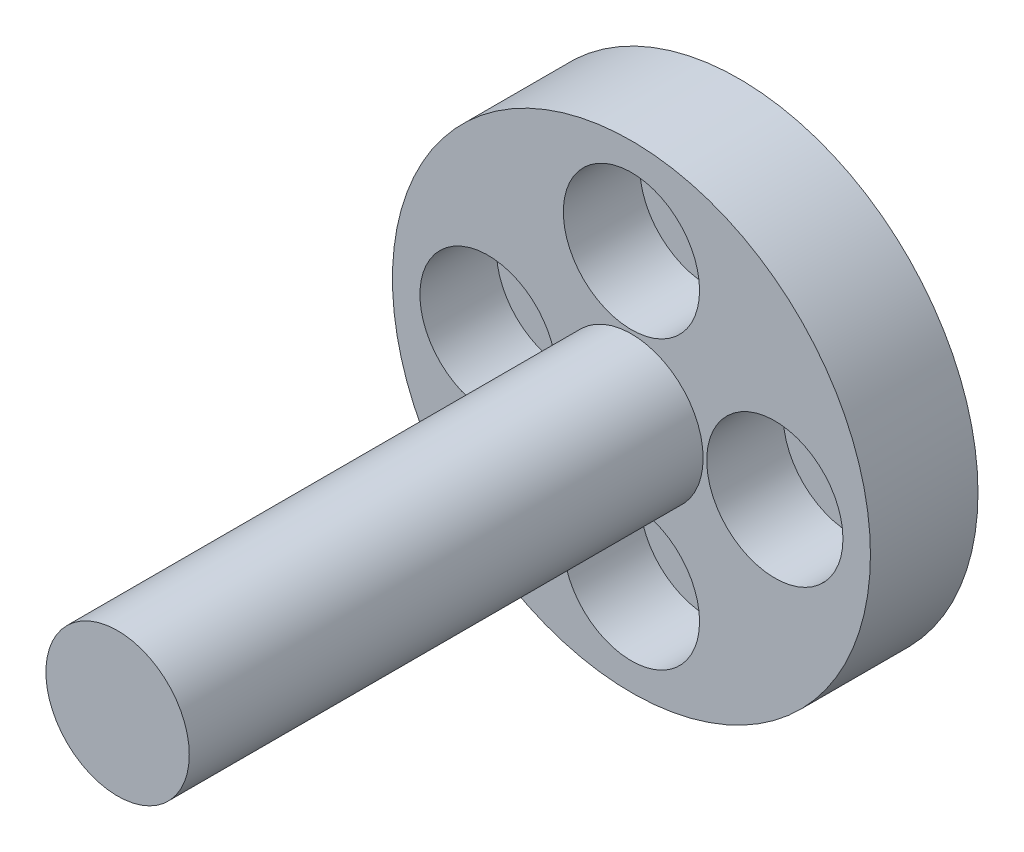
ISO-10303-21;
HEADER;
FILE_DESCRIPTION(('STEP AP214'),'2;1');
FILE_NAME('part.step','',(''),(''),'','','');
FILE_SCHEMA(('AUTOMOTIVE_DESIGN { 1 0 10303 214 1 1 1 1 }'));
ENDSEC;
DATA;
#1=APPLICATION_CONTEXT('core data for automotive mechanical design processes');
#2=APPLICATION_PROTOCOL_DEFINITION('international standard','automotive_design',2000,#1);
#3=PRODUCT_CONTEXT('',#1,'mechanical');
#4=PRODUCT('Part','Part','',(#3));
#5=PRODUCT_RELATED_PRODUCT_CATEGORY('part','',(#4));
#6=PRODUCT_DEFINITION_FORMATION('','',#4);
#7=PRODUCT_DEFINITION_CONTEXT('part definition',#1,'design');
#8=PRODUCT_DEFINITION('design','',#6,#7);
#9=PRODUCT_DEFINITION_SHAPE('','',#8);
#10=(LENGTH_UNIT() NAMED_UNIT(*) SI_UNIT(.MILLI.,.METRE.));
#11=(NAMED_UNIT(*) PLANE_ANGLE_UNIT() SI_UNIT($,.RADIAN.));
#12=(NAMED_UNIT(*) SI_UNIT($,.STERADIAN.) SOLID_ANGLE_UNIT());
#13=UNCERTAINTY_MEASURE_WITH_UNIT(LENGTH_MEASURE(1.E-05),#10,'distance_accuracy_value','');
#14=(GEOMETRIC_REPRESENTATION_CONTEXT(3) GLOBAL_UNCERTAINTY_ASSIGNED_CONTEXT((#13)) GLOBAL_UNIT_ASSIGNED_CONTEXT((#10,
#11,#12)) REPRESENTATION_CONTEXT('',''));
#15=CARTESIAN_POINT('',(0.,0.,0.));
#16=DIRECTION('',(0.,0.,1.));
#17=DIRECTION('',(1.,0.,0.));
#18=AXIS2_PLACEMENT_3D('',#15,#16,#17);
#19=CARTESIAN_POINT('',(6.,0.,26.));
#20=DIRECTION('',(0.,0.,-1.));
#21=DIRECTION('',(-1.,0.,0.));
#22=AXIS2_PLACEMENT_3D('',#19,#20,#21);
#23=CYLINDRICAL_SURFACE('',#22,1.60000000000006);
#24=CARTESIAN_POINT('',(6.,0.,0.));
#25=DIRECTION('',(0.,0.,-1.));
#26=DIRECTION('',(-1.,0.,0.));
#27=AXIS2_PLACEMENT_3D('',#24,#25,#26);
#28=CIRCLE('',#27,1.60000000000006);
#29=CARTESIAN_POINT('',(4.39999999999994,0.,0.));
#30=VERTEX_POINT('',#29);
#31=EDGE_CURVE('E70',#30,#30,#28,.T.);
#32=ORIENTED_EDGE('',*,*,#31,.T.);
#33=EDGE_LOOP('',(#32));
#34=FACE_BOUND('',#33,.T.);
#35=CARTESIAN_POINT('',(6.,0.,1.3));
#36=DIRECTION('',(0.,0.,1.));
#37=DIRECTION('',(1.,0.,0.));
#38=AXIS2_PLACEMENT_3D('',#35,#36,#37);
#39=CIRCLE('',#38,1.60000000000006);
#40=CARTESIAN_POINT('',(7.60000000000006,0.,1.3));
#41=VERTEX_POINT('',#40);
#42=EDGE_CURVE('E42',#41,#41,#39,.F.);
#43=ORIENTED_EDGE('',*,*,#42,.F.);
#44=EDGE_LOOP('',(#43));
#45=FACE_BOUND('',#44,.T.);
#46=ADVANCED_FACE('F38',(#34,#45),#23,.F.);
#47=CARTESIAN_POINT('',(0.,-6.,26.));
#48=DIRECTION('',(0.,0.,-1.));
#49=DIRECTION('',(-1.,0.,0.));
#50=AXIS2_PLACEMENT_3D('',#47,#48,#49);
#51=CYLINDRICAL_SURFACE('',#50,1.60000000000004);
#52=CARTESIAN_POINT('',(0.,-6.,0.));
#53=DIRECTION('',(0.,0.,-1.));
#54=DIRECTION('',(-1.,0.,0.));
#55=AXIS2_PLACEMENT_3D('',#52,#53,#54);
#56=CIRCLE('',#55,1.60000000000004);
#57=CARTESIAN_POINT('',(-1.60000000000004,-6.,0.));
#58=VERTEX_POINT('',#57);
#59=EDGE_CURVE('E74',#58,#58,#56,.T.);
#60=ORIENTED_EDGE('',*,*,#59,.T.);
#61=EDGE_LOOP('',(#60));
#62=FACE_BOUND('',#61,.T.);
#63=CARTESIAN_POINT('',(0.,-6.,1.3));
#64=DIRECTION('',(0.,0.,1.));
#65=DIRECTION('',(1.,0.,0.));
#66=AXIS2_PLACEMENT_3D('',#63,#64,#65);
#67=CIRCLE('',#66,1.60000000000004);
#68=CARTESIAN_POINT('',(1.60000000000004,-6.,1.3));
#69=VERTEX_POINT('',#68);
#70=EDGE_CURVE('E65',#69,#69,#67,.F.);
#71=ORIENTED_EDGE('',*,*,#70,.F.);
#72=EDGE_LOOP('',(#71));
#73=FACE_BOUND('',#72,.T.);
#74=ADVANCED_FACE('F160',(#62,#73),#51,.F.);
#75=CARTESIAN_POINT('',(-6.,0.,26.));
#76=DIRECTION('',(0.,0.,-1.));
#77=DIRECTION('',(-1.,0.,0.));
#78=AXIS2_PLACEMENT_3D('',#75,#76,#77);
#79=CYLINDRICAL_SURFACE('',#78,1.60000000000002);
#80=CARTESIAN_POINT('',(-6.,0.,0.));
#81=DIRECTION('',(0.,0.,-1.));
#82=DIRECTION('',(-1.,0.,0.));
#83=AXIS2_PLACEMENT_3D('',#80,#81,#82);
#84=CIRCLE('',#83,1.60000000000002);
#85=CARTESIAN_POINT('',(-7.60000000000002,0.,0.));
#86=VERTEX_POINT('',#85);
#87=EDGE_CURVE('E79',#86,#86,#84,.T.);
#88=ORIENTED_EDGE('',*,*,#87,.T.);
#89=EDGE_LOOP('',(#88));
#90=FACE_BOUND('',#89,.T.);
#91=CARTESIAN_POINT('',(-6.,0.,1.3));
#92=DIRECTION('',(0.,0.,1.));
#93=DIRECTION('',(1.,0.,0.));
#94=AXIS2_PLACEMENT_3D('',#91,#92,#93);
#95=CIRCLE('',#94,1.60000000000002);
#96=CARTESIAN_POINT('',(-4.39999999999998,0.,1.3));
#97=VERTEX_POINT('',#96);
#98=EDGE_CURVE('E62',#97,#97,#95,.F.);
#99=ORIENTED_EDGE('',*,*,#98,.F.);
#100=EDGE_LOOP('',(#99));
#101=FACE_BOUND('',#100,.T.);
#102=ADVANCED_FACE('F165',(#90,#101),#79,.F.);
#103=CARTESIAN_POINT('',(0.,6.,26.));
#104=DIRECTION('',(0.,0.,-1.));
#105=DIRECTION('',(-1.,0.,0.));
#106=AXIS2_PLACEMENT_3D('',#103,#104,#105);
#107=CYLINDRICAL_SURFACE('',#106,1.6);
#108=CARTESIAN_POINT('',(0.,6.,0.));
#109=DIRECTION('',(0.,0.,-1.));
#110=DIRECTION('',(-1.,0.,0.));
#111=AXIS2_PLACEMENT_3D('',#108,#109,#110);
#112=CIRCLE('',#111,1.6);
#113=CARTESIAN_POINT('',(-1.6,6.,0.));
#114=VERTEX_POINT('',#113);
#115=EDGE_CURVE('E87',#114,#114,#112,.T.);
#116=ORIENTED_EDGE('',*,*,#115,.T.);
#117=EDGE_LOOP('',(#116));
#118=FACE_BOUND('',#117,.T.);
#119=CARTESIAN_POINT('',(0.,6.,1.3));
#120=DIRECTION('',(0.,0.,1.));
#121=DIRECTION('',(1.,0.,0.));
#122=AXIS2_PLACEMENT_3D('',#119,#120,#121);
#123=CIRCLE('',#122,1.6);
#124=CARTESIAN_POINT('',(1.6,6.,1.3));
#125=VERTEX_POINT('',#124);
#126=EDGE_CURVE('E59',#125,#125,#123,.F.);
#127=ORIENTED_EDGE('',*,*,#126,.F.);
#128=EDGE_LOOP('',(#127));
#129=FACE_BOUND('',#128,.T.);
#130=ADVANCED_FACE('F146',(#118,#129),#107,.F.);
#131=CARTESIAN_POINT('',(0.,0.,4.5));
#132=DIRECTION('',(0.,0.,-1.));
#133=DIRECTION('',(-1.,0.,0.));
#134=AXIS2_PLACEMENT_3D('',#131,#132,#133);
#135=CYLINDRICAL_SURFACE('',#134,10.);
#136=CARTESIAN_POINT('',(0.,0.,4.5));
#137=DIRECTION('',(0.,0.,1.));
#138=DIRECTION('',(1.,0.,0.));
#139=AXIS2_PLACEMENT_3D('',#136,#137,#138);
#140=CIRCLE('',#139,10.);
#141=CARTESIAN_POINT('',(10.,0.,4.5));
#142=VERTEX_POINT('',#141);
#143=EDGE_CURVE('E46',#142,#142,#140,.T.);
#144=ORIENTED_EDGE('',*,*,#143,.F.);
#145=EDGE_LOOP('',(#144));
#146=FACE_BOUND('',#145,.T.);
#147=CARTESIAN_POINT('',(0.,0.,0.));
#148=DIRECTION('',(0.,0.,1.));
#149=DIRECTION('',(1.,0.,0.));
#150=AXIS2_PLACEMENT_3D('',#147,#148,#149);
#151=CIRCLE('',#150,10.);
#152=CARTESIAN_POINT('',(10.,0.,0.));
#153=VERTEX_POINT('',#152);
#154=EDGE_CURVE('E51',#153,#153,#151,.T.);
#155=ORIENTED_EDGE('',*,*,#154,.T.);
#156=EDGE_LOOP('',(#155));
#157=FACE_BOUND('',#156,.T.);
#158=ADVANCED_FACE('F40',(#146,#157),#135,.T.);
#159=CARTESIAN_POINT('',(0.,0.,4.5));
#160=DIRECTION('',(0.,0.,1.));
#161=DIRECTION('',(1.,0.,0.));
#162=AXIS2_PLACEMENT_3D('',#159,#160,#161);
#163=PLANE('',#162);
#164=CARTESIAN_POINT('',(0.,6.,4.5));
#165=DIRECTION('',(0.,0.,1.));
#166=DIRECTION('',(1.,0.,0.));
#167=AXIS2_PLACEMENT_3D('',#164,#165,#166);
#168=CIRCLE('',#167,2.85);
#169=CARTESIAN_POINT('',(2.85,6.,4.5));
#170=VERTEX_POINT('',#169);
#171=EDGE_CURVE('E114',#170,#170,#168,.T.);
#172=ORIENTED_EDGE('',*,*,#171,.F.);
#173=EDGE_LOOP('',(#172));
#174=FACE_BOUND('',#173,.T.);
#175=CARTESIAN_POINT('',(6.00000000000017,1.69428074463191E-13,4.5));
#176=DIRECTION('',(0.,0.,1.));
#177=DIRECTION('',(1.,0.,0.));
#178=AXIS2_PLACEMENT_3D('',#175,#176,#177);
#179=CIRCLE('',#178,2.85000000000013);
#180=CARTESIAN_POINT('',(8.8500000000003,1.69428074463191E-13,4.5));
#181=VERTEX_POINT('',#180);
#182=EDGE_CURVE('E108',#181,#181,#179,.T.);
#183=ORIENTED_EDGE('',*,*,#182,.F.);
#184=EDGE_LOOP('',(#183));
#185=FACE_BOUND('',#184,.T.);
#186=CARTESIAN_POINT('',(3.38856148926383E-13,-6.,4.5));
#187=DIRECTION('',(0.,0.,1.));
#188=DIRECTION('',(1.,0.,0.));
#189=AXIS2_PLACEMENT_3D('',#186,#187,#188);
#190=CIRCLE('',#189,2.85000000000036);
#191=CARTESIAN_POINT('',(2.8500000000007,-6.,4.5));
#192=VERTEX_POINT('',#191);
#193=EDGE_CURVE('E102',#192,#192,#190,.T.);
#194=ORIENTED_EDGE('',*,*,#193,.F.);
#195=EDGE_LOOP('',(#194));
#196=FACE_BOUND('',#195,.T.);
#197=CARTESIAN_POINT('',(-5.99999999999983,-1.7016286254268E-13,4.5));
#198=DIRECTION('',(0.,0.,1.));
#199=DIRECTION('',(1.,0.,0.));
#200=AXIS2_PLACEMENT_3D('',#197,#198,#199);
#201=CIRCLE('',#200,2.85000000000027);
#202=CARTESIAN_POINT('',(-3.14999999999956,-1.7016286254268E-13,4.5));
#203=VERTEX_POINT('',#202);
#204=EDGE_CURVE('E96',#203,#203,#201,.T.);
#205=ORIENTED_EDGE('',*,*,#204,.F.);
#206=EDGE_LOOP('',(#205));
#207=FACE_BOUND('',#206,.T.);
#208=CARTESIAN_POINT('',(0.,0.,4.5));
#209=DIRECTION('',(0.,0.,1.));
#210=DIRECTION('',(1.,0.,0.));
#211=AXIS2_PLACEMENT_3D('',#208,#209,#210);
#212=CIRCLE('',#211,3.);
#213=CARTESIAN_POINT('',(3.,0.,4.5));
#214=VERTEX_POINT('',#213);
#215=EDGE_CURVE('E10',#214,#214,#212,.T.);
#216=ORIENTED_EDGE('',*,*,#215,.F.);
#217=EDGE_LOOP('',(#216));
#218=FACE_BOUND('',#217,.T.);
#219=ORIENTED_EDGE('',*,*,#143,.T.);
#220=EDGE_LOOP('',(#219));
#221=FACE_BOUND('',#220,.T.);
#222=ADVANCED_FACE('F130',(#174,#185,#196,#207,#218,#221),#163,.T.);
#223=CARTESIAN_POINT('',(0.,0.,0.));
#224=DIRECTION('',(0.,0.,1.));
#225=DIRECTION('',(1.,0.,0.));
#226=AXIS2_PLACEMENT_3D('',#223,#224,#225);
#227=PLANE('',#226);
#228=ORIENTED_EDGE('',*,*,#115,.F.);
#229=EDGE_LOOP('',(#228));
#230=FACE_BOUND('',#229,.T.);
#231=ORIENTED_EDGE('',*,*,#87,.F.);
#232=EDGE_LOOP('',(#231));
#233=FACE_BOUND('',#232,.T.);
#234=ORIENTED_EDGE('',*,*,#59,.F.);
#235=EDGE_LOOP('',(#234));
#236=FACE_BOUND('',#235,.T.);
#237=ORIENTED_EDGE('',*,*,#31,.F.);
#238=EDGE_LOOP('',(#237));
#239=FACE_BOUND('',#238,.T.);
#240=CARTESIAN_POINT('',(0.,0.,0.));
#241=DIRECTION('',(0.,0.,-1.));
#242=DIRECTION('',(-1.,0.,0.));
#243=AXIS2_PLACEMENT_3D('',#240,#241,#242);
#244=CIRCLE('',#243,2.);
#245=CARTESIAN_POINT('',(-2.,0.,0.));
#246=VERTEX_POINT('',#245);
#247=EDGE_CURVE('E85',#246,#246,#244,.T.);
#248=ORIENTED_EDGE('',*,*,#247,.F.);
#249=EDGE_LOOP('',(#248));
#250=FACE_BOUND('',#249,.T.);
#251=ORIENTED_EDGE('',*,*,#154,.F.);
#252=EDGE_LOOP('',(#251));
#253=FACE_BOUND('',#252,.T.);
#254=ADVANCED_FACE('F133',(#230,#233,#236,#239,#250,#253),#227,.F.);
#255=CARTESIAN_POINT('',(0.,0.,26.));
#256=DIRECTION('',(0.,0.,-1.));
#257=DIRECTION('',(-1.,0.,0.));
#258=AXIS2_PLACEMENT_3D('',#255,#256,#257);
#259=CYLINDRICAL_SURFACE('',#258,3.);
#260=CARTESIAN_POINT('',(0.,0.,26.));
#261=DIRECTION('',(0.,0.,1.));
#262=DIRECTION('',(1.,0.,0.));
#263=AXIS2_PLACEMENT_3D('',#260,#261,#262);
#264=CIRCLE('',#263,3.);
#265=CARTESIAN_POINT('',(3.,0.,26.));
#266=VERTEX_POINT('',#265);
#267=EDGE_CURVE('E54',#266,#266,#264,.T.);
#268=ORIENTED_EDGE('',*,*,#267,.F.);
#269=EDGE_LOOP('',(#268));
#270=FACE_BOUND('',#269,.T.);
#271=ORIENTED_EDGE('',*,*,#215,.T.);
#272=EDGE_LOOP('',(#271));
#273=FACE_BOUND('',#272,.T.);
#274=ADVANCED_FACE('F150',(#270,#273),#259,.T.);
#275=CARTESIAN_POINT('',(0.,0.,26.));
#276=DIRECTION('',(0.,0.,1.));
#277=DIRECTION('',(1.,0.,0.));
#278=AXIS2_PLACEMENT_3D('',#275,#276,#277);
#279=PLANE('',#278);
#280=ORIENTED_EDGE('',*,*,#267,.T.);
#281=EDGE_LOOP('',(#280));
#282=FACE_BOUND('',#281,.T.);
#283=ADVANCED_FACE('F155',(#282),#279,.T.);
#284=CARTESIAN_POINT('',(0.,0.,6.5));
#285=DIRECTION('',(0.,0.,-1.));
#286=DIRECTION('',(-1.,0.,0.));
#287=AXIS2_PLACEMENT_3D('',#284,#285,#286);
#288=CYLINDRICAL_SURFACE('',#287,2.);
#289=CARTESIAN_POINT('',(0.,0.,6.5));
#290=DIRECTION('',(0.,0.,-1.));
#291=DIRECTION('',(-1.,0.,0.));
#292=AXIS2_PLACEMENT_3D('',#289,#290,#291);
#293=CIRCLE('',#292,2.);
#294=CARTESIAN_POINT('',(-2.,0.,6.5));
#295=VERTEX_POINT('',#294);
#296=EDGE_CURVE('E83',#295,#295,#293,.T.);
#297=ORIENTED_EDGE('',*,*,#296,.F.);
#298=EDGE_LOOP('',(#297));
#299=FACE_BOUND('',#298,.T.);
#300=ORIENTED_EDGE('',*,*,#247,.T.);
#301=EDGE_LOOP('',(#300));
#302=FACE_BOUND('',#301,.T.);
#303=ADVANCED_FACE('F174',(#299,#302),#288,.F.);
#304=CARTESIAN_POINT('',(0.,0.,6.5));
#305=DIRECTION('',(0.,0.,-1.));
#306=DIRECTION('',(-1.,0.,0.));
#307=AXIS2_PLACEMENT_3D('',#304,#305,#306);
#308=PLANE('',#307);
#309=ORIENTED_EDGE('',*,*,#296,.T.);
#310=EDGE_LOOP('',(#309));
#311=FACE_BOUND('',#310,.T.);
#312=ADVANCED_FACE('F171',(#311),#308,.T.);
#313=CARTESIAN_POINT('',(0.,6.,1.3));
#314=DIRECTION('',(0.,0.,1.));
#315=DIRECTION('',(1.,0.,0.));
#316=AXIS2_PLACEMENT_3D('',#313,#314,#315);
#317=PLANE('',#316);
#318=CARTESIAN_POINT('',(0.,6.,1.3));
#319=DIRECTION('',(0.,0.,1.));
#320=DIRECTION('',(1.,0.,0.));
#321=AXIS2_PLACEMENT_3D('',#318,#319,#320);
#322=CIRCLE('',#321,2.85);
#323=CARTESIAN_POINT('',(2.85,6.,1.3));
#324=VERTEX_POINT('',#323);
#325=EDGE_CURVE('E63',#324,#324,#322,.T.);
#326=ORIENTED_EDGE('',*,*,#325,.T.);
#327=EDGE_LOOP('',(#326));
#328=FACE_BOUND('',#327,.T.);
#329=ORIENTED_EDGE('',*,*,#126,.T.);
#330=EDGE_LOOP('',(#329));
#331=FACE_BOUND('',#330,.T.);
#332=ADVANCED_FACE('F120',(#328,#331),#317,.T.);
#333=CARTESIAN_POINT('',(0.,6.,1.3));
#334=DIRECTION('',(0.,0.,1.));
#335=DIRECTION('',(1.,0.,0.));
#336=AXIS2_PLACEMENT_3D('',#333,#334,#335);
#337=CYLINDRICAL_SURFACE('',#336,2.85);
#338=ORIENTED_EDGE('',*,*,#325,.F.);
#339=EDGE_LOOP('',(#338));
#340=FACE_BOUND('',#339,.T.);
#341=ORIENTED_EDGE('',*,*,#171,.T.);
#342=EDGE_LOOP('',(#341));
#343=FACE_BOUND('',#342,.T.);
#344=ADVANCED_FACE('F123',(#340,#343),#337,.F.);
#345=CARTESIAN_POINT('',(-5.99999999999983,-1.7016286254268E-13,1.3));
#346=DIRECTION('',(0.,0.,1.));
#347=DIRECTION('',(1.,0.,0.));
#348=AXIS2_PLACEMENT_3D('',#345,#346,#347);
#349=PLANE('',#348);
#350=CARTESIAN_POINT('',(-5.99999999999983,-1.7016286254268E-13,1.3));
#351=DIRECTION('',(0.,0.,1.));
#352=DIRECTION('',(1.,0.,0.));
#353=AXIS2_PLACEMENT_3D('',#350,#351,#352);
#354=CIRCLE('',#353,2.85000000000027);
#355=CARTESIAN_POINT('',(-3.14999999999956,-1.7016286254268E-13,1.3));
#356=VERTEX_POINT('',#355);
#357=EDGE_CURVE('E99',#356,#356,#354,.T.);
#358=ORIENTED_EDGE('',*,*,#357,.T.);
#359=EDGE_LOOP('',(#358));
#360=FACE_BOUND('',#359,.T.);
#361=ORIENTED_EDGE('',*,*,#98,.T.);
#362=EDGE_LOOP('',(#361));
#363=FACE_BOUND('',#362,.T.);
#364=ADVANCED_FACE('F126',(#360,#363),#349,.T.);
#365=CARTESIAN_POINT('',(-5.99999999999983,-1.7016286254268E-13,1.3));
#366=DIRECTION('',(0.,0.,1.));
#367=DIRECTION('',(1.,0.,0.));
#368=AXIS2_PLACEMENT_3D('',#365,#366,#367);
#369=CYLINDRICAL_SURFACE('',#368,2.85000000000027);
#370=ORIENTED_EDGE('',*,*,#357,.F.);
#371=EDGE_LOOP('',(#370));
#372=FACE_BOUND('',#371,.T.);
#373=ORIENTED_EDGE('',*,*,#204,.T.);
#374=EDGE_LOOP('',(#373));
#375=FACE_BOUND('',#374,.T.);
#376=ADVANCED_FACE('F214',(#372,#375),#369,.F.);
#377=CARTESIAN_POINT('',(3.38856148926383E-13,-6.,1.3));
#378=DIRECTION('',(0.,0.,1.));
#379=DIRECTION('',(1.,0.,0.));
#380=AXIS2_PLACEMENT_3D('',#377,#378,#379);
#381=PLANE('',#380);
#382=CARTESIAN_POINT('',(3.38856148926383E-13,-6.,1.3));
#383=DIRECTION('',(0.,0.,1.));
#384=DIRECTION('',(1.,0.,0.));
#385=AXIS2_PLACEMENT_3D('',#382,#383,#384);
#386=CIRCLE('',#385,2.85000000000036);
#387=CARTESIAN_POINT('',(2.8500000000007,-6.,1.3));
#388=VERTEX_POINT('',#387);
#389=EDGE_CURVE('E105',#388,#388,#386,.T.);
#390=ORIENTED_EDGE('',*,*,#389,.T.);
#391=EDGE_LOOP('',(#390));
#392=FACE_BOUND('',#391,.T.);
#393=ORIENTED_EDGE('',*,*,#70,.T.);
#394=EDGE_LOOP('',(#393));
#395=FACE_BOUND('',#394,.T.);
#396=ADVANCED_FACE('F222',(#392,#395),#381,.T.);
#397=CARTESIAN_POINT('',(3.38856148926383E-13,-6.,1.3));
#398=DIRECTION('',(0.,0.,1.));
#399=DIRECTION('',(1.,0.,0.));
#400=AXIS2_PLACEMENT_3D('',#397,#398,#399);
#401=CYLINDRICAL_SURFACE('',#400,2.85000000000036);
#402=ORIENTED_EDGE('',*,*,#389,.F.);
#403=EDGE_LOOP('',(#402));
#404=FACE_BOUND('',#403,.T.);
#405=ORIENTED_EDGE('',*,*,#193,.T.);
#406=EDGE_LOOP('',(#405));
#407=FACE_BOUND('',#406,.T.);
#408=ADVANCED_FACE('F230',(#404,#407),#401,.F.);
#409=CARTESIAN_POINT('',(6.00000000000017,1.69428074463191E-13,1.3));
#410=DIRECTION('',(0.,0.,1.));
#411=DIRECTION('',(1.,0.,0.));
#412=AXIS2_PLACEMENT_3D('',#409,#410,#411);
#413=PLANE('',#412);
#414=CARTESIAN_POINT('',(6.00000000000017,1.69428074463191E-13,1.3));
#415=DIRECTION('',(0.,0.,1.));
#416=DIRECTION('',(1.,0.,0.));
#417=AXIS2_PLACEMENT_3D('',#414,#415,#416);
#418=CIRCLE('',#417,2.85000000000013);
#419=CARTESIAN_POINT('',(8.8500000000003,1.69428074463191E-13,1.3));
#420=VERTEX_POINT('',#419);
#421=EDGE_CURVE('E111',#420,#420,#418,.T.);
#422=ORIENTED_EDGE('',*,*,#421,.T.);
#423=EDGE_LOOP('',(#422));
#424=FACE_BOUND('',#423,.T.);
#425=ORIENTED_EDGE('',*,*,#42,.T.);
#426=EDGE_LOOP('',(#425));
#427=FACE_BOUND('',#426,.T.);
#428=ADVANCED_FACE('F238',(#424,#427),#413,.T.);
#429=CARTESIAN_POINT('',(6.00000000000017,1.69428074463191E-13,1.3));
#430=DIRECTION('',(0.,0.,1.));
#431=DIRECTION('',(1.,0.,0.));
#432=AXIS2_PLACEMENT_3D('',#429,#430,#431);
#433=CYLINDRICAL_SURFACE('',#432,2.85000000000013);
#434=ORIENTED_EDGE('',*,*,#421,.F.);
#435=EDGE_LOOP('',(#434));
#436=FACE_BOUND('',#435,.T.);
#437=ORIENTED_EDGE('',*,*,#182,.T.);
#438=EDGE_LOOP('',(#437));
#439=FACE_BOUND('',#438,.T.);
#440=ADVANCED_FACE('F246',(#436,#439),#433,.F.);
#441=CLOSED_SHELL('',(#46,#74,#102,#130,#158,#222,#254,#274,#283,#303,#312,#332,#344,#364,#376,
#396,#408,#428,#440));
#442=MANIFOLD_SOLID_BREP('B2',#441);
#443=ADVANCED_BREP_SHAPE_REPRESENTATION('',(#18,#442),#14);
#444=SHAPE_DEFINITION_REPRESENTATION(#9,#443);
ENDSEC;
END-ISO-10303-21;
